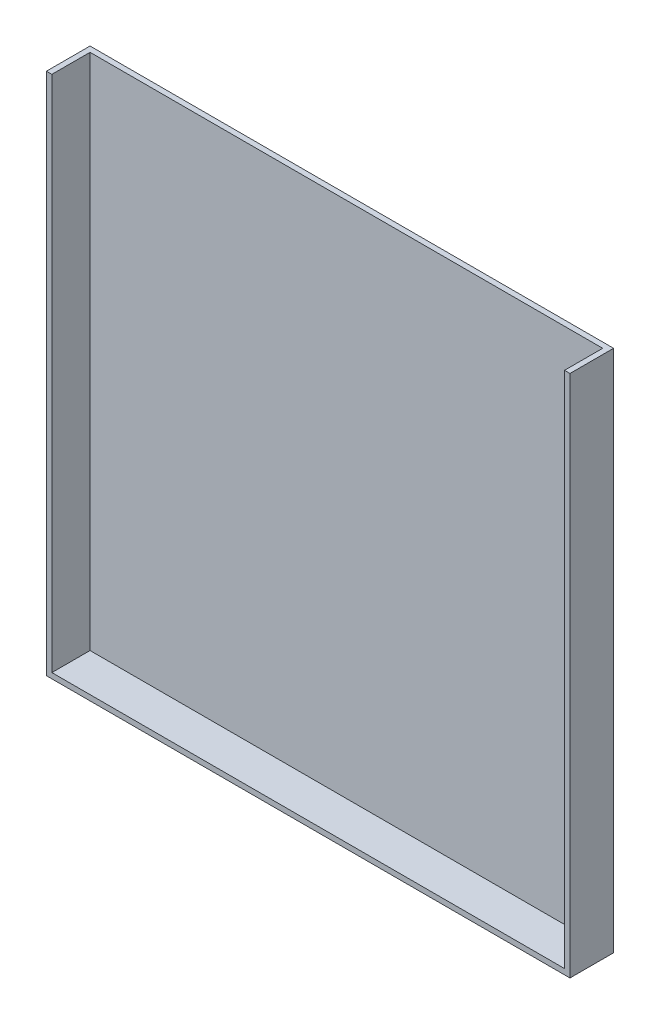
ISO-10303-21;
HEADER;
FILE_DESCRIPTION(('STEP AP214'),'2;1');
FILE_NAME('part.step','',(''),(''),'','','');
FILE_SCHEMA(('AUTOMOTIVE_DESIGN { 1 0 10303 214 1 1 1 1 }'));
ENDSEC;
DATA;
#1=APPLICATION_CONTEXT('core data for automotive mechanical design processes');
#2=APPLICATION_PROTOCOL_DEFINITION('international standard','automotive_design',2000,#1);
#3=PRODUCT_CONTEXT('',#1,'mechanical');
#4=PRODUCT('Part','Part','',(#3));
#5=PRODUCT_RELATED_PRODUCT_CATEGORY('part','',(#4));
#6=PRODUCT_DEFINITION_FORMATION('','',#4);
#7=PRODUCT_DEFINITION_CONTEXT('part definition',#1,'design');
#8=PRODUCT_DEFINITION('design','',#6,#7);
#9=PRODUCT_DEFINITION_SHAPE('','',#8);
#10=(LENGTH_UNIT() NAMED_UNIT(*) SI_UNIT(.MILLI.,.METRE.));
#11=(NAMED_UNIT(*) PLANE_ANGLE_UNIT() SI_UNIT($,.RADIAN.));
#12=(NAMED_UNIT(*) SI_UNIT($,.STERADIAN.) SOLID_ANGLE_UNIT());
#13=UNCERTAINTY_MEASURE_WITH_UNIT(LENGTH_MEASURE(1.E-05),#10,'distance_accuracy_value','');
#14=(GEOMETRIC_REPRESENTATION_CONTEXT(3) GLOBAL_UNCERTAINTY_ASSIGNED_CONTEXT((#13)) GLOBAL_UNIT_ASSIGNED_CONTEXT((#10,
#11,#12)) REPRESENTATION_CONTEXT('',''));
#15=CARTESIAN_POINT('',(0.,0.,0.));
#16=DIRECTION('',(0.,0.,1.));
#17=DIRECTION('',(1.,0.,0.));
#18=AXIS2_PLACEMENT_3D('',#15,#16,#17);
#19=CARTESIAN_POINT('',(0.,0.,25.4));
#20=DIRECTION('',(0.,0.,-1.));
#21=DIRECTION('',(-1.,0.,0.));
#22=AXIS2_PLACEMENT_3D('',#19,#20,#21);
#23=PLANE('',#22);
#24=DIRECTION('',(0.,-1.,0.));
#25=VECTOR('',#24,1.);
#26=CARTESIAN_POINT('',(3.175,0.,25.4));
#27=LINE('',#26,#25);
#28=CARTESIAN_POINT('',(3.175,304.8,25.4));
#29=VERTEX_POINT('',#28);
#30=CARTESIAN_POINT('',(3.175,3.175,25.4));
#31=VERTEX_POINT('',#30);
#32=EDGE_CURVE('E130',#29,#31,#27,.T.);
#33=ORIENTED_EDGE('',*,*,#32,.F.);
#34=DIRECTION('',(-1.,0.,0.));
#35=VECTOR('',#34,1.);
#36=CARTESIAN_POINT('',(0.,304.8,25.4));
#37=LINE('',#36,#35);
#38=CARTESIAN_POINT('',(0.,304.8,25.4));
#39=VERTEX_POINT('',#38);
#40=EDGE_CURVE('E57',#29,#39,#37,.T.);
#41=ORIENTED_EDGE('',*,*,#40,.T.);
#42=DIRECTION('',(0.,-1.,0.));
#43=VECTOR('',#42,1.);
#44=CARTESIAN_POINT('',(0.,0.,25.4));
#45=LINE('',#44,#43);
#46=CARTESIAN_POINT('',(0.,0.,25.4));
#47=VERTEX_POINT('',#46);
#48=EDGE_CURVE('E141',#39,#47,#45,.T.);
#49=ORIENTED_EDGE('',*,*,#48,.T.);
#50=DIRECTION('',(1.,0.,0.));
#51=VECTOR('',#50,1.);
#52=CARTESIAN_POINT('',(0.,0.,25.4));
#53=LINE('',#52,#51);
#54=CARTESIAN_POINT('',(304.8,0.,25.4));
#55=VERTEX_POINT('',#54);
#56=EDGE_CURVE('E86',#47,#55,#53,.T.);
#57=ORIENTED_EDGE('',*,*,#56,.T.);
#58=DIRECTION('',(0.,1.,0.));
#59=VECTOR('',#58,1.);
#60=CARTESIAN_POINT('',(304.8,0.,25.4));
#61=LINE('',#60,#59);
#62=CARTESIAN_POINT('',(304.8,304.8,25.4));
#63=VERTEX_POINT('',#62);
#64=EDGE_CURVE('E144',#55,#63,#61,.T.);
#65=ORIENTED_EDGE('',*,*,#64,.T.);
#66=CARTESIAN_POINT('',(301.625,304.8,25.4));
#67=VERTEX_POINT('',#66);
#68=EDGE_CURVE('E146',#63,#67,#37,.T.);
#69=ORIENTED_EDGE('',*,*,#68,.T.);
#70=DIRECTION('',(0.,1.,0.));
#71=VECTOR('',#70,1.);
#72=CARTESIAN_POINT('',(301.625,0.,25.4));
#73=LINE('',#72,#71);
#74=CARTESIAN_POINT('',(301.625,3.175,25.4));
#75=VERTEX_POINT('',#74);
#76=EDGE_CURVE('E135',#75,#67,#73,.T.);
#77=ORIENTED_EDGE('',*,*,#76,.F.);
#78=DIRECTION('',(1.,0.,0.));
#79=VECTOR('',#78,1.);
#80=CARTESIAN_POINT('',(0.,3.175,25.4));
#81=LINE('',#80,#79);
#82=EDGE_CURVE('E120',#31,#75,#81,.T.);
#83=ORIENTED_EDGE('',*,*,#82,.F.);
#84=EDGE_LOOP('',(#33,#41,#49,#57,#65,#69,#77,#83));
#85=FACE_BOUND('',#84,.T.);
#86=ADVANCED_FACE('F33',(#85),#23,.F.);
#87=CARTESIAN_POINT('',(0.,0.,25.4));
#88=DIRECTION('',(1.,0.,0.));
#89=DIRECTION('',(0.,0.,-1.));
#90=AXIS2_PLACEMENT_3D('',#87,#88,#89);
#91=PLANE('',#90);
#92=DIRECTION('',(0.,-1.,0.));
#93=VECTOR('',#92,1.);
#94=CARTESIAN_POINT('',(0.,0.,0.));
#95=LINE('',#94,#93);
#96=CARTESIAN_POINT('',(0.,304.8,0.));
#97=VERTEX_POINT('',#96);
#98=CARTESIAN_POINT('',(0.,0.,0.));
#99=VERTEX_POINT('',#98);
#100=EDGE_CURVE('E150',#97,#99,#95,.T.);
#101=ORIENTED_EDGE('',*,*,#100,.T.);
#102=DIRECTION('',(0.,0.,-1.));
#103=VECTOR('',#102,1.);
#104=CARTESIAN_POINT('',(0.,0.,25.4));
#105=LINE('',#104,#103);
#106=EDGE_CURVE('E11',#47,#99,#105,.T.);
#107=ORIENTED_EDGE('',*,*,#106,.F.);
#108=ORIENTED_EDGE('',*,*,#48,.F.);
#109=DIRECTION('',(0.,0.,-1.));
#110=VECTOR('',#109,1.);
#111=CARTESIAN_POINT('',(0.,304.8,25.4));
#112=LINE('',#111,#110);
#113=EDGE_CURVE('E149',#39,#97,#112,.T.);
#114=ORIENTED_EDGE('',*,*,#113,.T.);
#115=EDGE_LOOP('',(#101,#107,#108,#114));
#116=FACE_BOUND('',#115,.T.);
#117=ADVANCED_FACE('F35',(#116),#91,.F.);
#118=CARTESIAN_POINT('',(0.,0.,25.4));
#119=DIRECTION('',(0.,1.,0.));
#120=DIRECTION('',(0.,0.,1.));
#121=AXIS2_PLACEMENT_3D('',#118,#119,#120);
#122=PLANE('',#121);
#123=DIRECTION('',(1.,0.,0.));
#124=VECTOR('',#123,1.);
#125=CARTESIAN_POINT('',(0.,0.,0.));
#126=LINE('',#125,#124);
#127=CARTESIAN_POINT('',(304.8,0.,0.));
#128=VERTEX_POINT('',#127);
#129=EDGE_CURVE('E153',#99,#128,#126,.T.);
#130=ORIENTED_EDGE('',*,*,#129,.T.);
#131=DIRECTION('',(0.,0.,-1.));
#132=VECTOR('',#131,1.);
#133=CARTESIAN_POINT('',(304.8,0.,25.4));
#134=LINE('',#133,#132);
#135=EDGE_CURVE('E41',#55,#128,#134,.T.);
#136=ORIENTED_EDGE('',*,*,#135,.F.);
#137=ORIENTED_EDGE('',*,*,#56,.F.);
#138=ORIENTED_EDGE('',*,*,#106,.T.);
#139=EDGE_LOOP('',(#130,#136,#137,#138));
#140=FACE_BOUND('',#139,.T.);
#141=ADVANCED_FACE('F181',(#140),#122,.F.);
#142=CARTESIAN_POINT('',(304.8,0.,25.4));
#143=DIRECTION('',(-1.,0.,0.));
#144=DIRECTION('',(0.,0.,1.));
#145=AXIS2_PLACEMENT_3D('',#142,#143,#144);
#146=PLANE('',#145);
#147=DIRECTION('',(0.,1.,0.));
#148=VECTOR('',#147,1.);
#149=CARTESIAN_POINT('',(304.8,0.,0.));
#150=LINE('',#149,#148);
#151=CARTESIAN_POINT('',(304.8,304.8,0.));
#152=VERTEX_POINT('',#151);
#153=EDGE_CURVE('E155',#128,#152,#150,.T.);
#154=ORIENTED_EDGE('',*,*,#153,.T.);
#155=DIRECTION('',(0.,0.,-1.));
#156=VECTOR('',#155,1.);
#157=CARTESIAN_POINT('',(304.8,304.8,25.4));
#158=LINE('',#157,#156);
#159=EDGE_CURVE('E159',#63,#152,#158,.T.);
#160=ORIENTED_EDGE('',*,*,#159,.F.);
#161=ORIENTED_EDGE('',*,*,#64,.F.);
#162=ORIENTED_EDGE('',*,*,#135,.T.);
#163=EDGE_LOOP('',(#154,#160,#161,#162));
#164=FACE_BOUND('',#163,.T.);
#165=ADVANCED_FACE('F164',(#164),#146,.F.);
#166=CARTESIAN_POINT('',(0.,304.8,25.4));
#167=DIRECTION('',(0.,-1.,0.));
#168=DIRECTION('',(0.,0.,-1.));
#169=AXIS2_PLACEMENT_3D('',#166,#167,#168);
#170=PLANE('',#169);
#171=ORIENTED_EDGE('',*,*,#40,.F.);
#172=DIRECTION('',(0.,0.,-1.));
#173=VECTOR('',#172,1.);
#174=CARTESIAN_POINT('',(3.175,304.8,25.4));
#175=LINE('',#174,#173);
#176=CARTESIAN_POINT('',(3.175,304.8,3.175));
#177=VERTEX_POINT('',#176);
#178=EDGE_CURVE('E137',#29,#177,#175,.T.);
#179=ORIENTED_EDGE('',*,*,#178,.T.);
#180=DIRECTION('',(-1.,0.,0.));
#181=VECTOR('',#180,1.);
#182=CARTESIAN_POINT('',(0.,304.8,3.175));
#183=LINE('',#182,#181);
#184=CARTESIAN_POINT('',(301.625,304.8,3.175));
#185=VERTEX_POINT('',#184);
#186=EDGE_CURVE('E128',#185,#177,#183,.T.);
#187=ORIENTED_EDGE('',*,*,#186,.F.);
#188=DIRECTION('',(0.,0.,-1.));
#189=VECTOR('',#188,1.);
#190=CARTESIAN_POINT('',(301.625,304.8,25.4));
#191=LINE('',#190,#189);
#192=EDGE_CURVE('E123',#67,#185,#191,.T.);
#193=ORIENTED_EDGE('',*,*,#192,.F.);
#194=ORIENTED_EDGE('',*,*,#68,.F.);
#195=ORIENTED_EDGE('',*,*,#159,.T.);
#196=DIRECTION('',(-1.,0.,0.));
#197=VECTOR('',#196,1.);
#198=CARTESIAN_POINT('',(0.,304.8,0.));
#199=LINE('',#198,#197);
#200=EDGE_CURVE('E79',#152,#97,#199,.T.);
#201=ORIENTED_EDGE('',*,*,#200,.T.);
#202=ORIENTED_EDGE('',*,*,#113,.F.);
#203=EDGE_LOOP('',(#171,#179,#187,#193,#194,#195,#201,#202));
#204=FACE_BOUND('',#203,.T.);
#205=ADVANCED_FACE('F172',(#204),#170,.F.);
#206=CARTESIAN_POINT('',(0.,0.,0.));
#207=DIRECTION('',(0.,0.,-1.));
#208=DIRECTION('',(-1.,0.,0.));
#209=AXIS2_PLACEMENT_3D('',#206,#207,#208);
#210=PLANE('',#209);
#211=ORIENTED_EDGE('',*,*,#100,.F.);
#212=ORIENTED_EDGE('',*,*,#200,.F.);
#213=ORIENTED_EDGE('',*,*,#153,.F.);
#214=ORIENTED_EDGE('',*,*,#129,.F.);
#215=EDGE_LOOP('',(#211,#212,#213,#214));
#216=FACE_BOUND('',#215,.T.);
#217=ADVANCED_FACE('F168',(#216),#210,.T.);
#218=CARTESIAN_POINT('',(3.175,0.,25.4));
#219=DIRECTION('',(1.,0.,0.));
#220=DIRECTION('',(0.,0.,-1.));
#221=AXIS2_PLACEMENT_3D('',#218,#219,#220);
#222=PLANE('',#221);
#223=DIRECTION('',(0.,-1.,0.));
#224=VECTOR('',#223,1.);
#225=CARTESIAN_POINT('',(3.175,0.,3.175));
#226=LINE('',#225,#224);
#227=CARTESIAN_POINT('',(3.175,3.175,3.175));
#228=VERTEX_POINT('',#227);
#229=EDGE_CURVE('E113',#177,#228,#226,.T.);
#230=ORIENTED_EDGE('',*,*,#229,.F.);
#231=ORIENTED_EDGE('',*,*,#178,.F.);
#232=ORIENTED_EDGE('',*,*,#32,.T.);
#233=DIRECTION('',(0.,0.,-1.));
#234=VECTOR('',#233,1.);
#235=CARTESIAN_POINT('',(3.175,3.175,25.4));
#236=LINE('',#235,#234);
#237=EDGE_CURVE('E122',#31,#228,#236,.T.);
#238=ORIENTED_EDGE('',*,*,#237,.T.);
#239=EDGE_LOOP('',(#230,#231,#232,#238));
#240=FACE_BOUND('',#239,.T.);
#241=ADVANCED_FACE('F174',(#240),#222,.T.);
#242=CARTESIAN_POINT('',(0.,3.175,25.4));
#243=DIRECTION('',(0.,1.,0.));
#244=DIRECTION('',(0.,0.,1.));
#245=AXIS2_PLACEMENT_3D('',#242,#243,#244);
#246=PLANE('',#245);
#247=DIRECTION('',(1.,0.,0.));
#248=VECTOR('',#247,1.);
#249=CARTESIAN_POINT('',(0.,3.175,3.175));
#250=LINE('',#249,#248);
#251=CARTESIAN_POINT('',(301.625,3.175,3.175));
#252=VERTEX_POINT('',#251);
#253=EDGE_CURVE('E108',#228,#252,#250,.T.);
#254=ORIENTED_EDGE('',*,*,#253,.F.);
#255=ORIENTED_EDGE('',*,*,#237,.F.);
#256=ORIENTED_EDGE('',*,*,#82,.T.);
#257=DIRECTION('',(0.,0.,-1.));
#258=VECTOR('',#257,1.);
#259=CARTESIAN_POINT('',(301.625,3.175,25.4));
#260=LINE('',#259,#258);
#261=EDGE_CURVE('E48',#75,#252,#260,.T.);
#262=ORIENTED_EDGE('',*,*,#261,.T.);
#263=EDGE_LOOP('',(#254,#255,#256,#262));
#264=FACE_BOUND('',#263,.T.);
#265=ADVANCED_FACE('F118',(#264),#246,.T.);
#266=CARTESIAN_POINT('',(301.625,0.,25.4));
#267=DIRECTION('',(-1.,0.,0.));
#268=DIRECTION('',(0.,0.,1.));
#269=AXIS2_PLACEMENT_3D('',#266,#267,#268);
#270=PLANE('',#269);
#271=DIRECTION('',(0.,1.,0.));
#272=VECTOR('',#271,1.);
#273=CARTESIAN_POINT('',(301.625,0.,3.175));
#274=LINE('',#273,#272);
#275=EDGE_CURVE('E110',#252,#185,#274,.T.);
#276=ORIENTED_EDGE('',*,*,#275,.F.);
#277=ORIENTED_EDGE('',*,*,#261,.F.);
#278=ORIENTED_EDGE('',*,*,#76,.T.);
#279=ORIENTED_EDGE('',*,*,#192,.T.);
#280=EDGE_LOOP('',(#276,#277,#278,#279));
#281=FACE_BOUND('',#280,.T.);
#282=ADVANCED_FACE('F125',(#281),#270,.T.);
#283=CARTESIAN_POINT('',(0.,0.,3.175));
#284=DIRECTION('',(0.,0.,-1.));
#285=DIRECTION('',(-1.,0.,0.));
#286=AXIS2_PLACEMENT_3D('',#283,#284,#285);
#287=PLANE('',#286);
#288=ORIENTED_EDGE('',*,*,#229,.T.);
#289=ORIENTED_EDGE('',*,*,#253,.T.);
#290=ORIENTED_EDGE('',*,*,#275,.T.);
#291=ORIENTED_EDGE('',*,*,#186,.T.);
#292=EDGE_LOOP('',(#288,#289,#290,#291));
#293=FACE_BOUND('',#292,.T.);
#294=ADVANCED_FACE('F109',(#293),#287,.F.);
#295=CLOSED_SHELL('',(#86,#117,#141,#165,#205,#217,#241,#265,#282,#294));
#296=MANIFOLD_SOLID_BREP('B2',#295);
#297=ADVANCED_BREP_SHAPE_REPRESENTATION('',(#18,#296),#14);
#298=SHAPE_DEFINITION_REPRESENTATION(#9,#297);
ENDSEC;
END-ISO-10303-21;
